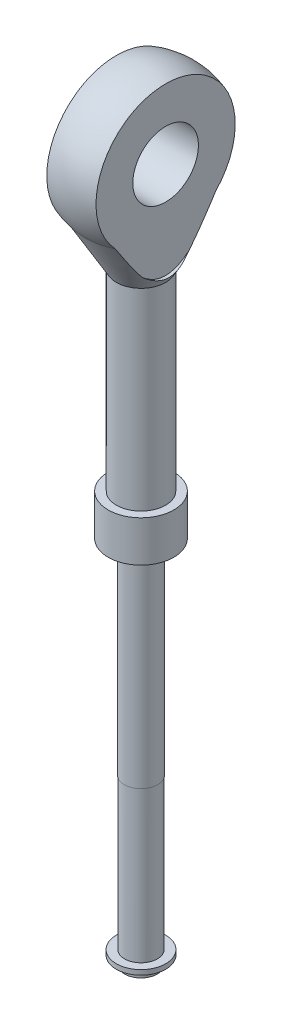
ISO-10303-21;
HEADER;
FILE_DESCRIPTION(('STEP AP214'),'2;1');
FILE_NAME('part.step','',(''),(''),'','','');
FILE_SCHEMA(('AUTOMOTIVE_DESIGN { 1 0 10303 214 1 1 1 1 }'));
ENDSEC;
DATA;
#1=APPLICATION_CONTEXT('core data for automotive mechanical design processes');
#2=APPLICATION_PROTOCOL_DEFINITION('international standard','automotive_design',2000,#1);
#3=PRODUCT_CONTEXT('',#1,'mechanical');
#4=PRODUCT('Part','Part','',(#3));
#5=PRODUCT_RELATED_PRODUCT_CATEGORY('part','',(#4));
#6=PRODUCT_DEFINITION_FORMATION('','',#4);
#7=PRODUCT_DEFINITION_CONTEXT('part definition',#1,'design');
#8=PRODUCT_DEFINITION('design','',#6,#7);
#9=PRODUCT_DEFINITION_SHAPE('','',#8);
#10=(LENGTH_UNIT() NAMED_UNIT(*) SI_UNIT(.MILLI.,.METRE.));
#11=(NAMED_UNIT(*) PLANE_ANGLE_UNIT() SI_UNIT($,.RADIAN.));
#12=(NAMED_UNIT(*) SI_UNIT($,.STERADIAN.) SOLID_ANGLE_UNIT());
#13=UNCERTAINTY_MEASURE_WITH_UNIT(LENGTH_MEASURE(1.E-05),#10,'distance_accuracy_value','');
#14=(GEOMETRIC_REPRESENTATION_CONTEXT(3) GLOBAL_UNCERTAINTY_ASSIGNED_CONTEXT((#13)) GLOBAL_UNIT_ASSIGNED_CONTEXT((#10,
#11,#12)) REPRESENTATION_CONTEXT('',''));
#15=CARTESIAN_POINT('',(0.,0.,0.));
#16=DIRECTION('',(0.,0.,1.));
#17=DIRECTION('',(1.,0.,0.));
#18=AXIS2_PLACEMENT_3D('',#15,#16,#17);
#19=CARTESIAN_POINT('',(0.,86.0040086442886,0.));
#20=DIRECTION('',(0.,1.,0.));
#21=DIRECTION('',(-1.,0.,0.));
#22=AXIS2_PLACEMENT_3D('',#19,#20,#21);
#23=SPHERICAL_SURFACE('',#22,9.);
#24=CARTESIAN_POINT('',(3.,86.0040086442886,0.));
#25=DIRECTION('',(-1.,0.,0.));
#26=DIRECTION('',(0.,0.,1.));
#27=AXIS2_PLACEMENT_3D('',#24,#25,#26);
#28=CIRCLE('',#27,8.48528137423857);
#29=CARTESIAN_POINT('',(3.,80.1211860557444,-6.11493241105035));
#30=VERTEX_POINT('',#29);
#31=CARTESIAN_POINT('',(3.,80.1211860557444,6.11493241105034));
#32=VERTEX_POINT('',#31);
#33=EDGE_CURVE('E84',#30,#32,#28,.F.);
#34=ORIENTED_EDGE('',*,*,#33,.F.);
#35=CARTESIAN_POINT('',(0.,80.1211860557444,0.));
#36=DIRECTION('',(0.,1.,0.));
#37=DIRECTION('',(-1.,0.,0.));
#38=AXIS2_PLACEMENT_3D('',#35,#36,#37);
#39=CIRCLE('',#38,6.81119654625485);
#40=CARTESIAN_POINT('',(-3.,80.1211860557444,-6.11493241105034));
#41=VERTEX_POINT('',#40);
#42=EDGE_CURVE('E188',#30,#41,#39,.T.);
#43=ORIENTED_EDGE('',*,*,#42,.T.);
#44=CARTESIAN_POINT('',(-3.,86.0040086442886,0.));
#45=DIRECTION('',(1.,0.,0.));
#46=DIRECTION('',(0.,0.,-1.));
#47=AXIS2_PLACEMENT_3D('',#44,#45,#46);
#48=CIRCLE('',#47,8.48528137423857);
#49=CARTESIAN_POINT('',(-3.,80.1211860557444,6.11493241105035));
#50=VERTEX_POINT('',#49);
#51=EDGE_CURVE('E229',#50,#41,#48,.F.);
#52=ORIENTED_EDGE('',*,*,#51,.F.);
#53=EDGE_CURVE('E104',#50,#32,#39,.T.);
#54=ORIENTED_EDGE('',*,*,#53,.T.);
#55=EDGE_LOOP('',(#34,#43,#52,#54));
#56=FACE_BOUND('',#55,.T.);
#57=ADVANCED_FACE('F40',(#56),#23,.T.);
#58=CARTESIAN_POINT('',(0.,80.1211860557444,0.));
#59=DIRECTION('',(0.,1.,0.));
#60=DIRECTION('',(-1.,0.,0.));
#61=AXIS2_PLACEMENT_3D('',#58,#59,#60);
#62=CONICAL_SURFACE('',#61,6.81119654625485,0.5235987755983);
#63=CARTESIAN_POINT('',(3.,90.0317216097129,12.168700218284));
#64=CARTESIAN_POINT('',(3.,89.4382406915781,11.8157499478809));
#65=CARTESIAN_POINT('',(3.,88.8451075580213,11.4622109965136));
#66=CARTESIAN_POINT('',(3.,87.659781910573,10.7533686630429));
#67=CARTESIAN_POINT('',(3.,87.067589543096,10.3980650361896));
#68=CARTESIAN_POINT('',(3.,85.8818106051358,9.68354997630611));
#69=CARTESIAN_POINT('',(3.,85.2882303494418,9.32432805553555));
#70=CARTESIAN_POINT('',(3.,84.1030618730578,8.60277571787523));
#71=CARTESIAN_POINT('',(3.,83.5114734077622,8.24044570362834));
#72=CARTESIAN_POINT('',(3.,82.6225023997788,7.69121429969309));
#73=CARTESIAN_POINT('',(3.,82.3240659074994,7.50601921420662));
#74=CARTESIAN_POINT('',(3.,81.7281047680208,7.13416838224338));
#75=CARTESIAN_POINT('',(3.,81.4305801180743,6.9475126401734));
#76=CARTESIAN_POINT('',(3.,80.8365627508458,6.57230122932124));
#77=CARTESIAN_POINT('',(3.,80.5400704961296,6.38374482741769));
#78=CARTESIAN_POINT('',(3.,79.9485858454352,6.00430627463545));
#79=CARTESIAN_POINT('',(3.,79.6535934141857,5.81342417881189));
#80=CARTESIAN_POINT('',(3.,79.066268517673,5.42906288453613));
#81=CARTESIAN_POINT('',(3.,78.7739314959773,5.23559066657474));
#82=CARTESIAN_POINT('',(3.,78.1919893856413,4.84459280960307));
#83=CARTESIAN_POINT('',(3.,77.9023842091294,4.64706730162282));
#84=CARTESIAN_POINT('',(3.,77.3272309546283,4.24652122906827));
#85=CARTESIAN_POINT('',(3.,77.0416804971072,4.0435041092877));
#86=CARTESIAN_POINT('',(3.,76.6178706443515,3.73286576399993));
#87=CARTESIAN_POINT('',(3.,76.4773653220144,3.62831020391789));
#88=CARTESIAN_POINT('',(3.,76.1982777100872,3.41666704144675));
#89=CARTESIAN_POINT('',(3.,76.0596953112071,3.30957958390188));
#90=CARTESIAN_POINT('',(3.,75.8747989309065,3.16327040881801));
#91=CARTESIAN_POINT('',(3.,75.8273818467308,3.1254403633148));
#92=CARTESIAN_POINT('',(3.,75.7328802284512,3.04936468537061));
#93=CARTESIAN_POINT('',(3.,75.6857957030233,3.01111904215307));
#94=CARTESIAN_POINT('',(3.,75.5450867923799,2.89570208608211));
#95=CARTESIAN_POINT('',(3.,75.4520135073028,2.81785582178286));
#96=CARTESIAN_POINT('',(3.,75.2673697404668,2.65974724133965));
#97=CARTESIAN_POINT('',(3.,75.1758056851449,2.57947739965793));
#98=CARTESIAN_POINT('',(3.,74.9950142544657,2.41635099384556));
#99=CARTESIAN_POINT('',(3.,74.9057867103646,2.33349461746816));
#100=CARTESIAN_POINT('',(3.,74.7253674914011,2.15984324306048));
#101=CARTESIAN_POINT('',(3.,74.6343515198,2.06886453738304));
#102=CARTESIAN_POINT('',(3.,74.4568090319896,1.88249940937497));
#103=CARTESIAN_POINT('',(3.,74.3702848488625,1.78711074414356));
#104=CARTESIAN_POINT('',(3.,74.203880753241,1.59128618412983));
#105=CARTESIAN_POINT('',(3.,74.1239762113704,1.49087145618605));
#106=CARTESIAN_POINT('',(3.,73.9732433626545,1.28351192700046));
#107=CARTESIAN_POINT('',(3.,73.9024029287037,1.17657613957347));
#108=CARTESIAN_POINT('',(3.,73.7805695996317,0.966451307545471));
#109=CARTESIAN_POINT('',(3.,73.7282789886254,0.864028431115715));
#110=CARTESIAN_POINT('',(3.,73.6386366009642,0.652732100806439));
#111=CARTESIAN_POINT('',(3.,73.6012619050635,0.543868840871251));
#112=CARTESIAN_POINT('',(3.,73.559781693372,0.37613413053505));
#113=CARTESIAN_POINT('',(3.,73.5483562281123,0.319041613266631));
#114=CARTESIAN_POINT('',(3.,73.5310608429829,0.204033323995488));
#115=CARTESIAN_POINT('',(3.,73.525187941715,0.146118010762109));
#116=CARTESIAN_POINT('',(3.,73.5192876580133,0.0299914911495062));
#117=CARTESIAN_POINT('',(3.,73.5192597381448,-0.0282196875332625));
#118=CARTESIAN_POINT('',(3.,73.525037139723,-0.14433696147935));
#119=CARTESIAN_POINT('',(3.,73.5308422992964,-0.202243065163956));
#120=CARTESIAN_POINT('',(3.,73.5542260815381,-0.358638552878588));
#121=CARTESIAN_POINT('',(3.,73.577271487356,-0.456338339746016));
#122=CARTESIAN_POINT('',(3.,73.6370722704449,-0.647301530251859));
#123=CARTESIAN_POINT('',(3.,73.6738331133625,-0.740563148537059));
#124=CARTESIAN_POINT('',(3.,73.755589077184,-0.917317207215517));
#125=CARTESIAN_POINT('',(3.,73.8000434455604,-1.00106543109804));
#126=CARTESIAN_POINT('',(3.,73.8960829635573,-1.16440859380673));
#127=CARTESIAN_POINT('',(3.,73.9476747246079,-1.24399958648436));
#128=CARTESIAN_POINT('',(3.,74.056463582699,-1.39978566722164));
#129=CARTESIAN_POINT('',(3.,74.1136866737394,-1.47596239525551));
#130=CARTESIAN_POINT('',(3.,74.2322051434531,-1.62499472393064));
#131=CARTESIAN_POINT('',(3.,74.2934986610117,-1.69785181705794));
#132=CARTESIAN_POINT('',(3.,74.416820749987,-1.83800833856632));
#133=CARTESIAN_POINT('',(3.,74.4787296507064,-1.90541373898406));
#134=CARTESIAN_POINT('',(3.,74.6048766456202,-2.03801479987947));
#135=CARTESIAN_POINT('',(3.,74.6691150517269,-2.10321016216323));
#136=CARTESIAN_POINT('',(3.,74.8646952607046,-2.29604275359632));
#137=CARTESIAN_POINT('',(3.,74.9988293778066,-2.42084603276168));
#138=CARTESIAN_POINT('',(3.,75.2723919204941,-2.66509747567585));
#139=CARTESIAN_POINT('',(3.,75.4118321346984,-2.78453225378144));
#140=CARTESIAN_POINT('',(3.,75.6943011652691,-3.01909976029167));
#141=CARTESIAN_POINT('',(3.,75.8373304351151,-3.13423194043869));
#142=CARTESIAN_POINT('',(3.,76.1272104428136,-3.36206864070766));
#143=CARTESIAN_POINT('',(3.,76.2740829689065,-3.47474530811504));
#144=CARTESIAN_POINT('',(3.,76.5698730828963,-3.69739679538881));
#145=CARTESIAN_POINT('',(3.,76.7187908198471,-3.80737141668492));
#146=CARTESIAN_POINT('',(3.,77.0179652511954,-4.02495482493047));
#147=CARTESIAN_POINT('',(3.,77.1682193274144,-4.13256721989711));
#148=CARTESIAN_POINT('',(3.,77.4699844271883,-4.34600183579561));
#149=CARTESIAN_POINT('',(3.,77.6214954123623,-4.4518241110927));
#150=CARTESIAN_POINT('',(3.,78.027757288913,-4.73265188833206));
#151=CARTESIAN_POINT('',(3.,78.2834245611178,-4.90633111554133));
#152=CARTESIAN_POINT('',(3.,78.7968345072581,-5.25059867156036));
#153=CARTESIAN_POINT('',(3.,79.0545772379262,-5.42118691546101));
#154=CARTESIAN_POINT('',(3.,79.5716523174998,-5.75998735813319));
#155=CARTESIAN_POINT('',(3.,79.8309848134444,-5.92819933221733));
#156=CARTESIAN_POINT('',(3.,80.3508668509719,-6.26273339980395));
#157=CARTESIAN_POINT('',(3.,80.6114164016771,-6.42905547910877));
#158=CARTESIAN_POINT('',(3.,81.3950642347187,-6.92612513901488));
#159=CARTESIAN_POINT('',(3.,81.9195976970134,-7.25460920510274));
#160=CARTESIAN_POINT('',(3.,82.9711419209881,-7.907509826911));
#161=CARTESIAN_POINT('',(3.,83.4981525461237,-8.23192660329294));
#162=CARTESIAN_POINT('',(3.,84.5246793943521,-8.85997517248131));
#163=CARTESIAN_POINT('',(3.,85.0241005947331,-9.16376240686782));
#164=CARTESIAN_POINT('',(3.,86.0241163223545,-9.76941744177886));
#165=CARTESIAN_POINT('',(3.,86.524710869848,-10.0712852088328));
#166=CARTESIAN_POINT('',(3.,87.5259893999254,-10.6730697781595));
#167=CARTESIAN_POINT('',(3.,88.0266719793256,-10.9729889166156));
#168=CARTESIAN_POINT('',(3.,89.028724270981,-11.5716505637281));
#169=CARTESIAN_POINT('',(3.,89.5300939668022,-11.8703930998859));
#170=CARTESIAN_POINT('',(3.,90.0317216097129,-12.168700218284));
#171=B_SPLINE_CURVE_WITH_KNOTS('',3,(#63,#64,#65,#66,#67,#68,#69,#70,#71,#72,#73,#74,#75,#76,
#77,#78,#79,#80,#81,#82,#83,#84,#85,#86,#87,#88,#89,#90,#91,#92,#93,#94,#95,#96,#97,#98,#99,
#100,#101,#102,#103,#104,#105,#106,#107,#108,#109,#110,#111,#112,#113,#114,#115,#116,#117,#118,
#119,#120,#121,#122,#123,#124,#125,#126,#127,#128,#129,#130,#131,#132,#133,#134,#135,#136,#137,
#138,#139,#140,#141,#142,#143,#144,#145,#146,#147,#148,#149,#150,#151,#152,#153,#154,#155,#156,
#157,#158,#159,#160,#161,#162,#163,#164,#165,#166,#167,#168,#169,#170),.UNSPECIFIED.,.F.,.F.,(4,
2,2,2,2,2,2,2,2,2,2,2,2,2,2,2,2,2,2,2,2,2,2,2,2,2,2,2,2,2,2,2,2,2,2,2,2,2,2,2,2,2,2,2,2,2,2,2,2,
2,2,2,2,4),(0.,2.07150978561819,4.14331538084254,6.22475142290114,8.30592177615951,
9.35960450625591,10.4132840586324,11.4673868982463,12.5214648328506,13.5731191803613,
14.6247395846088,15.6757149606122,16.2011115258233,16.7264781066445,16.9084526211625,
17.0904318656428,17.4544149359295,17.8196764181021,18.1849114477817,18.5708648295201,
18.9570167139165,19.3416604870031,19.7257841308158,20.0699752859951,20.4136355144541,
20.5880764974489,20.7624237626776,20.9367549970061,21.1110813936144,21.4108862712865,
21.7108107500127,21.9948126704668,22.2790794481779,22.56472612749,22.8502430884725,
23.1247405190978,23.3992748406117,23.9486681764211,24.4993629288371,25.0501276157957,
25.6054346266929,26.1607823251392,26.7152126471412,27.2696261009805,28.1968311261045,
29.1240615829944,30.0513791347962,30.9787036483837,32.8353711110087,34.6919374046442,
36.4456059209505,38.1993049333712,39.9502203360859,41.7010945677686),.UNSPECIFIED.);
#172=CARTESIAN_POINT('',(3.00000000000001,75.4236608623091,2.79312647703182));
#173=VERTEX_POINT('',#172);
#174=EDGE_CURVE('E80',#32,#173,#171,.T.);
#175=ORIENTED_EDGE('',*,*,#174,.F.);
#176=ORIENTED_EDGE('',*,*,#53,.F.);
#177=CARTESIAN_POINT('',(-3.,89.0244617467357,-11.5688580103673));
#178=CARTESIAN_POINT('',(-3.,88.4921295889113,-11.2513140874213));
#179=CARTESIAN_POINT('',(-3.,87.9601281346009,-10.9332123896199));
#180=CARTESIAN_POINT('',(-3.,86.8969693584094,-10.2953723277993));
#181=CARTESIAN_POINT('',(-3.,86.3658122172094,-9.97563366271791));
#182=CARTESIAN_POINT('',(-3.,85.3015811233849,-9.33221673054897));
#183=CARTESIAN_POINT('',(-3.,84.7685144918123,-9.00852634487636));
#184=CARTESIAN_POINT('',(-3.,83.7041821001664,-8.35840311324479));
#185=CARTESIAN_POINT('',(-3.,83.1729160389006,-8.03197076131658));
#186=CARTESIAN_POINT('',(-3.,82.3415839665515,-7.51688282348457));
#187=CARTESIAN_POINT('',(-3.,82.0406887849902,-7.32956588726583));
#188=CARTESIAN_POINT('',(-3.,81.4398971377041,-6.95333796050274));
#189=CARTESIAN_POINT('',(-3.,81.1400006684187,-6.76442697565008));
#190=CARTESIAN_POINT('',(-3.,80.5413061289178,-6.38448567772224));
#191=CARTESIAN_POINT('',(-3.,80.2425088025948,-6.19345419119735));
#192=CARTESIAN_POINT('',(-3.,79.6465929905049,-5.80880924172397));
#193=CARTESIAN_POINT('',(-3.,79.3494744429213,-5.61519587474048));
#194=CARTESIAN_POINT('',(-3.,78.7585049827187,-5.22521926498285));
#195=CARTESIAN_POINT('',(-3.,78.4646463599206,-5.02886772470208));
#196=CARTESIAN_POINT('',(-3.,77.8799953272648,-4.63152741527655));
#197=CARTESIAN_POINT('',(-3.,77.5892034024548,-4.43053792812963));
#198=CARTESIAN_POINT('',(-3.,77.1566252435166,-4.12424979070277));
#199=CARTESIAN_POINT('',(-3.,77.0131028491293,-4.02140411373894));
#200=CARTESIAN_POINT('',(-3.,76.7275060836031,-3.81372407979883));
#201=CARTESIAN_POINT('',(-3.,76.5854316756764,-3.70888977354067));
#202=CARTESIAN_POINT('',(-3.,76.3031504454941,-3.49681189166142));
#203=CARTESIAN_POINT('',(-3.,76.1629431189906,-3.38956898845638));
#204=CARTESIAN_POINT('',(-3.,75.884903950074,-3.17205375276586));
#205=CARTESIAN_POINT('',(-3.,75.7470719039783,-3.06178168215923));
#206=CARTESIAN_POINT('',(-3.,75.5461989275548,-2.89635709784405));
#207=CARTESIAN_POINT('',(-3.,75.4819265387069,-2.84269865255659));
#208=CARTESIAN_POINT('',(-3.,75.3542116715627,-2.73439486719465));
#209=CARTESIAN_POINT('',(-3.,75.2907692357431,-2.67974947694679));
#210=CARTESIAN_POINT('',(-3.,75.1648280320631,-2.56931903639512));
#211=CARTESIAN_POINT('',(-3.,75.1023297307238,-2.51353345278843));
#212=CARTESIAN_POINT('',(-3.,74.9784916386758,-2.40069350942453));
#213=CARTESIAN_POINT('',(-3.,74.9171518277429,-2.34363917185438));
#214=CARTESIAN_POINT('',(-3.,74.7361216226362,-2.17120048802878));
#215=CARTESIAN_POINT('',(-3.,74.618437133311,-2.05368877839343));
#216=CARTESIAN_POINT('',(-3.,74.3910097951584,-1.8112349691058));
#217=CARTESIAN_POINT('',(-3.,74.2812602427922,-1.68629930781483));
#218=CARTESIAN_POINT('',(-3.,74.135812889995,-1.50392647852383));
#219=CARTESIAN_POINT('',(-3.,74.0949476584839,-1.45061441757395));
#220=CARTESIAN_POINT('',(-3.,74.0156947442278,-1.34218343993368));
#221=CARTESIAN_POINT('',(-3.,73.9773069958032,-1.2870645712012));
#222=CARTESIAN_POINT('',(-3.,73.8665061594473,-1.11857807510415));
#223=CARTESIAN_POINT('',(-3.,73.7985466598955,-1.00219148050185));
#224=CARTESIAN_POINT('',(-3.,73.6794420522367,-0.758041198317624));
#225=CARTESIAN_POINT('',(-3.,73.6286181948079,-0.630111715681514));
#226=CARTESIAN_POINT('',(-3.,73.5725755103631,-0.4327387473672));
#227=CARTESIAN_POINT('',(-3.,73.5572680411791,-0.366138646046975));
#228=CARTESIAN_POINT('',(-3.,73.534180877927,-0.231632973810041));
#229=CARTESIAN_POINT('',(-3.,73.5263984679964,-0.163727882906772));
#230=CARTESIAN_POINT('',(-3.,73.5194249404224,-0.0374016592874153));
#231=CARTESIAN_POINT('',(-3.,73.519148309969,0.020961439206003));
#232=CARTESIAN_POINT('',(-3.,73.5244725210162,0.137437495824002));
#233=CARTESIAN_POINT('',(-3.,73.5300752994235,0.195550365178576));
#234=CARTESIAN_POINT('',(-3.,73.5468987432795,0.311025774104685));
#235=CARTESIAN_POINT('',(-3.,73.5581267157704,0.368387237903616));
#236=CARTESIAN_POINT('',(-3.,73.5857045521343,0.481882001013793));
#237=CARTESIAN_POINT('',(-3.,73.6020580503198,0.538014398532684));
#238=CARTESIAN_POINT('',(-3.,73.6685057115828,0.735706909897615));
#239=CARTESIAN_POINT('',(-3.,73.731275152493,0.873090585905248));
#240=CARTESIAN_POINT('',(-3.,73.8399787183451,1.07075374967075));
#241=CARTESIAN_POINT('',(-3.,73.8787236220289,1.13535139801526));
#242=CARTESIAN_POINT('',(-3.,73.9601467838349,1.26203631531047));
#243=CARTESIAN_POINT('',(-3.,74.0028242576449,1.32412408129389));
#244=CARTESIAN_POINT('',(-3.,74.1146798224324,1.4782041038997));
#245=CARTESIAN_POINT('',(-3.,74.1859471698282,1.56866673066896));
#246=CARTESIAN_POINT('',(-3.,74.3337736816723,1.74519275915911));
#247=CARTESIAN_POINT('',(-3.,74.4103359802488,1.83125350202931));
#248=CARTESIAN_POINT('',(-3.,74.5675216795534,1.99988677382243));
#249=CARTESIAN_POINT('',(-3.,74.6481530569388,2.08245181774962));
#250=CARTESIAN_POINT('',(-3.,74.8123970152884,2.24456606033062));
#251=CARTESIAN_POINT('',(-3.,74.8960099969697,2.32411485062387));
#252=CARTESIAN_POINT('',(-3.,75.0661030293614,2.48121981238464));
#253=CARTESIAN_POINT('',(-3.,75.1525983502752,2.55875938513696));
#254=CARTESIAN_POINT('',(-3.,75.3274439842175,2.71171904069293));
#255=CARTESIAN_POINT('',(-3.,75.4157943799672,2.78713902862838));
#256=CARTESIAN_POINT('',(-3.,75.59386128195,2.93608586725176));
#257=CARTESIAN_POINT('',(-3.,75.683575682059,3.00961524175049));
#258=CARTESIAN_POINT('',(-3.,75.8642222608192,3.15515193756142));
#259=CARTESIAN_POINT('',(-3.,75.9551543943272,3.22715931504282));
#260=CARTESIAN_POINT('',(-3.,76.2618461368404,3.46652422995947));
#261=CARTESIAN_POINT('',(-3.,76.4798911599765,3.63095419545278));
#262=CARTESIAN_POINT('',(-3.,76.9197403789327,3.95472030078216));
#263=CARTESIAN_POINT('',(-3.,77.1415450419487,4.11405580034195));
#264=CARTESIAN_POINT('',(-3.,77.5879162327383,4.42897773608877));
#265=CARTESIAN_POINT('',(-3.,77.8124837444079,4.58456277466135));
#266=CARTESIAN_POINT('',(-3.,78.2636076336265,4.89282399290127));
#267=CARTESIAN_POINT('',(-3.,78.490164053002,5.04550011117924));
#268=CARTESIAN_POINT('',(-3.,78.9451489045452,5.3488100943615));
#269=CARTESIAN_POINT('',(-3.,79.1735797081182,5.49944039657938));
#270=CARTESIAN_POINT('',(-3.,79.631637050792,5.79887457580867));
#271=CARTESIAN_POINT('',(-3.,79.861263602909,5.94767843287926));
#272=CARTESIAN_POINT('',(-3.,80.5514543256237,6.39181701266785));
#273=CARTESIAN_POINT('',(-3.,81.0134355200603,6.6849488569291));
#274=CARTESIAN_POINT('',(-3.,81.938228167338,7.26614146301739));
#275=CARTESIAN_POINT('',(-3.,82.4010305069388,7.55421677868495));
#276=CARTESIAN_POINT('',(-3.,83.3284365143108,8.12750777496666));
#277=CARTESIAN_POINT('',(-3.,83.7930402795362,8.41272329779089));
#278=CARTESIAN_POINT('',(-3.,84.7232454978762,8.98082980268928));
#279=CARTESIAN_POINT('',(-3.,85.1888460931005,9.26372219113208));
#280=CARTESIAN_POINT('',(-3.,86.1210354518243,9.82787426175203));
#281=CARTESIAN_POINT('',(-3.,86.5876242161852,10.1091339425049));
#282=CARTESIAN_POINT('',(-3.,87.2185343801636,10.4882698315908));
#283=CARTESIAN_POINT('',(-3.,87.3825191763526,10.5867067522454));
#284=CARTESIAN_POINT('',(-3.,87.7105895094916,10.7834423783616));
#285=CARTESIAN_POINT('',(-3.,87.8746750534496,10.8817410721395));
#286=CARTESIAN_POINT('',(-3.,88.2030076447442,11.0782522315111));
#287=CARTESIAN_POINT('',(-3.,88.3672547318212,11.1764646306968));
#288=CARTESIAN_POINT('',(-3.,88.6958103536837,11.3727565432624));
#289=CARTESIAN_POINT('',(-3.,88.8601188824584,11.470836066703));
#290=CARTESIAN_POINT('',(-3.,89.0244617467357,11.5688580103673));
#291=B_SPLINE_CURVE_WITH_KNOTS('',3,(#177,#178,#179,#180,#181,#182,#183,#184,#185,#186,#187,
#188,#189,#190,#191,#192,#193,#194,#195,#196,#197,#198,#199,#200,#201,#202,#203,#204,#205,#206,
#207,#208,#209,#210,#211,#212,#213,#214,#215,#216,#217,#218,#219,#220,#221,#222,#223,#224,#225,
#226,#227,#228,#229,#230,#231,#232,#233,#234,#235,#236,#237,#238,#239,#240,#241,#242,#243,#244,
#245,#246,#247,#248,#249,#250,#251,#252,#253,#254,#255,#256,#257,#258,#259,#260,#261,#262,#263,
#264,#265,#266,#267,#268,#269,#270,#271,#272,#273,#274,#275,#276,#277,#278,#279,#280,#281,#282,
#283,#284,#285,#286,#287,#288,#289,#290),.UNSPECIFIED.,.F.,.F.,(4,2,2,2,2,2,2,2,2,2,2,2,2,2,2,2,
2,2,2,2,2,2,2,2,2,2,2,2,2,2,2,2,2,2,2,2,2,2,2,2,2,2,2,2,2,2,2,2,2,2,2,2,2,2,2,2,4),(0.,
1.85954663345918,3.71944851825171,5.59038371775899,7.46098876085661,8.52429583523659,
9.58759911460017,10.6515234701854,11.715408390757,12.7756461226006,13.8360491062264,
14.3657372792316,14.8954119611507,15.4249405662478,15.9544235355014,16.2055958266256,
16.4567809227541,16.708086323515,16.9593873330773,17.4580903235018,17.9563669572525,
18.1578233890974,18.3592744780287,18.7626055000958,19.1731246676663,19.3777710647631,
19.5823435755109,19.7571431756228,19.9320003796273,20.1070853117173,20.2822946717081,
20.732461543658,20.9583848577246,21.184263210745,21.5294694371452,21.874881772468,
22.2209997285289,22.5671643782386,22.9156116989624,23.2640745907061,23.6120452310999,
23.9600030071575,24.7791633855382,25.5984263151211,26.417989966635,27.2375708949656,
28.0584320674992,28.8793021940994,30.5206613169523,32.1560576309606,33.79154368733,
35.4259533347038,37.0603644076027,37.6341479299448,38.2079773421529,38.7820896712543,
39.3561557847316),.UNSPECIFIED.);
#292=CARTESIAN_POINT('',(-3.,75.4236633253487,2.79312448322381));
#293=VERTEX_POINT('',#292);
#294=EDGE_CURVE('E192',#293,#50,#291,.T.);
#295=ORIENTED_EDGE('',*,*,#294,.F.);
#296=CARTESIAN_POINT('',(-3.,75.4232876539053,-2.79297030664514));
#297=CARTESIAN_POINT('',(-3.02439317343293,75.3521443282335,-2.70645602250348));
#298=CARTESIAN_POINT('',(-3.04837521829059,75.2826505739971,-2.61841294404533));
#299=CARTESIAN_POINT('',(-3.09540712839197,75.1472274300091,-2.4382784360176));
#300=CARTESIAN_POINT('',(-3.11844834877217,75.0813297670305,-2.34616096090762));
#301=CARTESIAN_POINT('',(-3.16316240566749,74.9543183287999,-2.15796244216656));
#302=CARTESIAN_POINT('',(-3.18483138568502,74.8932179294039,-2.06187138262452));
#303=CARTESIAN_POINT('',(-3.22669834518532,74.7760687070202,-1.86405577982547));
#304=CARTESIAN_POINT('',(-3.24686550944066,74.7201219520898,-1.76226372947855));
#305=CARTESIAN_POINT('',(-3.2848572802393,74.6159944780161,-1.55465386494298));
#306=CARTESIAN_POINT('',(-3.30268760809228,74.5677947236392,-1.44884673308011));
#307=CARTESIAN_POINT('',(-3.33534232282712,74.4803901388541,-1.23330545893428));
#308=CARTESIAN_POINT('',(-3.35017195009883,74.4411696111958,-1.12357856348331));
#309=CARTESIAN_POINT('',(-3.37319220171469,74.3805706736658,-0.925676968355511));
#310=CARTESIAN_POINT('',(-3.38212585052571,74.3571633193108,-0.838208994649943));
#311=CARTESIAN_POINT('',(-3.39750181093107,74.3170618470822,-0.661498803031819));
#312=CARTESIAN_POINT('',(-3.40394370325086,74.3003688589801,-0.572256289180739));
#313=CARTESIAN_POINT('',(-3.41404595353697,74.2742397880073,-0.393200045163183));
#314=CARTESIAN_POINT('',(-3.4177256654112,74.2647532059248,-0.303394821400617));
#315=CARTESIAN_POINT('',(-3.42222898278664,74.2531140793086,-0.123238371546315));
#316=CARTESIAN_POINT('',(-3.42305278418695,74.2509610317367,-0.0328871833305148));
#317=CARTESIAN_POINT('',(-3.42186345562618,74.2541513747348,0.147936669517103));
#318=CARTESIAN_POINT('',(-3.41984165463753,74.2595176778058,0.238408862537525));
#319=CARTESIAN_POINT('',(-3.41290436390222,74.2774138854433,0.418525411045759));
#320=CARTESIAN_POINT('',(-3.40798880007725,74.2899439733975,0.508169745281289));
#321=CARTESIAN_POINT('',(-3.3955450472824,74.322041857712,0.686266415702858));
#322=CARTESIAN_POINT('',(-3.38800930633637,74.341630003069,0.774714530116257));
#323=CARTESIAN_POINT('',(-3.37057228207257,74.3872868397698,0.949683163734498));
#324=CARTESIAN_POINT('',(-3.36067076290483,74.4133561772493,1.03620348981284));
#325=CARTESIAN_POINT('',(-3.34206289647834,74.4628161555517,1.1817230218025));
#326=CARTESIAN_POINT('',(-3.33386787770388,74.4847222471864,1.24130025609733));
#327=CARTESIAN_POINT('',(-3.31654127175512,74.5311898633868,1.35927436664196));
#328=CARTESIAN_POINT('',(-3.30740958979724,74.5557516567041,1.41767112271867));
#329=CARTESIAN_POINT('',(-3.27880442822637,74.6331663603971,1.59105323731095));
#330=CARTESIAN_POINT('',(-3.25812546574772,74.6897364107113,1.70419523583938));
#331=CARTESIAN_POINT('',(-3.21427394308575,74.8110802455301,1.92562891948412));
#332=CARTESIAN_POINT('',(-3.191097797445,74.8758658501789,2.03391330563359));
#333=CARTESIAN_POINT('',(-3.14283969185649,75.0120224305372,2.24574484538208));
#334=CARTESIAN_POINT('',(-3.11775830858518,75.0833914149833,2.3492934173323));
#335=CARTESIAN_POINT('',(-3.07704349660704,75.2002301609046,2.509261257828));
#336=CARTESIAN_POINT('',(-3.06189099722551,75.2439156977637,2.56712403112745));
#337=CARTESIAN_POINT('',(-3.03121995651082,75.3326962590517,2.68126366836316));
#338=CARTESIAN_POINT('',(-3.01570316709407,75.3777847830964,2.73754605375895));
#339=CARTESIAN_POINT('',(-3.,75.4235649674562,2.79320526875368));
#340=B_SPLINE_CURVE_WITH_KNOTS('',3,(#296,#297,#298,#299,#300,#301,#302,#303,#304,#305,#306,
#307,#308,#309,#310,#311,#312,#313,#314,#315,#316,#317,#318,#319,#320,#321,#322,#323,#324,#325,
#326,#327,#328,#329,#330,#331,#332,#333,#334,#335,#336,#337,#338,#339),.UNSPECIFIED.,.F.,.F.,(4,
2,2,2,2,2,2,2,2,2,2,2,2,2,2,2,2,2,2,2,2,4),(0.,0.343945524371265,0.690551362610133,
1.0380916180319,1.39146842644643,1.74396321779393,2.09583699971255,2.36852595572448,
2.64126077570995,2.91206630042778,3.18285324907188,3.45446711966491,3.72608794368719,
3.9984982238167,4.27093567250443,4.46287378464442,4.65483133874053,5.03885863538683,
5.42344485755969,5.80791513366485,6.03009392354628,6.25136339811525),.UNSPECIFIED.);
#341=CARTESIAN_POINT('',(-3.,75.4234069359673,-2.7928723675498));
#342=VERTEX_POINT('',#341);
#343=EDGE_CURVE('E102',#342,#293,#340,.T.);
#344=ORIENTED_EDGE('',*,*,#343,.F.);
#345=EDGE_CURVE('E238',#41,#342,#291,.T.);
#346=ORIENTED_EDGE('',*,*,#345,.F.);
#347=ORIENTED_EDGE('',*,*,#42,.F.);
#348=CARTESIAN_POINT('',(3.,75.4234088041381,-2.79287087160829));
#349=VERTEX_POINT('',#348);
#350=EDGE_CURVE('E101',#349,#30,#171,.T.);
#351=ORIENTED_EDGE('',*,*,#350,.F.);
#352=CARTESIAN_POINT('',(3.,75.4232876539053,-2.79297030664514));
#353=CARTESIAN_POINT('',(3.02439317343292,75.3521443282335,-2.70645602250349));
#354=CARTESIAN_POINT('',(3.04837521829058,75.2826505739971,-2.61841294404535));
#355=CARTESIAN_POINT('',(3.09540712839194,75.1472274300091,-2.43827843601764));
#356=CARTESIAN_POINT('',(3.11844834877214,75.0813297670305,-2.34616096090767));
#357=CARTESIAN_POINT('',(3.16316240566747,74.9543183287999,-2.15796244216662));
#358=CARTESIAN_POINT('',(3.18483138568501,74.893217929404,-2.0618713826246));
#359=CARTESIAN_POINT('',(3.22669834518531,74.7760687070203,-1.86405577982557));
#360=CARTESIAN_POINT('',(3.24686550944064,74.7201219520899,-1.76226372947867));
#361=CARTESIAN_POINT('',(3.28485728023927,74.6159944780162,-1.55465386494312));
#362=CARTESIAN_POINT('',(3.30268760809223,74.5677947236393,-1.44884673308027));
#363=CARTESIAN_POINT('',(3.33534232282709,74.4803901388541,-1.23330545893448));
#364=CARTESIAN_POINT('',(3.35017195009883,74.4411696111959,-1.12357856348353));
#365=CARTESIAN_POINT('',(3.37319220171468,74.3805706736658,-0.925676968355748));
#366=CARTESIAN_POINT('',(3.38212585052569,74.3571633193109,-0.838208994650175));
#367=CARTESIAN_POINT('',(3.39750181093104,74.3170618470822,-0.661498803032044));
#368=CARTESIAN_POINT('',(3.40394370325084,74.3003688589801,-0.572256289180961));
#369=CARTESIAN_POINT('',(3.41404595353696,74.2742397880073,-0.3932000451634));
#370=CARTESIAN_POINT('',(3.41772566541118,74.2647532059248,-0.303394821400831));
#371=CARTESIAN_POINT('',(3.42222898278664,74.2531140793086,-0.123238371546524));
#372=CARTESIAN_POINT('',(3.42305278418695,74.2509610317367,-0.0328871833307215));
#373=CARTESIAN_POINT('',(3.42186345562618,74.2541513747348,0.147936669516904));
#374=CARTESIAN_POINT('',(3.41984165463753,74.2595176778057,0.238408862537331));
#375=CARTESIAN_POINT('',(3.41290436390222,74.2774138854432,0.418525411045577));
#376=CARTESIAN_POINT('',(3.40798880007725,74.2899439733974,0.508169745281112));
#377=CARTESIAN_POINT('',(3.39554504728241,74.3220418577119,0.686266415702688));
#378=CARTESIAN_POINT('',(3.38800930633639,74.341630003069,0.774714530116088));
#379=CARTESIAN_POINT('',(3.37057228207259,74.3872868397698,0.949683163734339));
#380=CARTESIAN_POINT('',(3.36067076290485,74.4133561772492,1.03620348981269));
#381=CARTESIAN_POINT('',(3.34206289647837,74.4628161555516,1.18172302180232));
#382=CARTESIAN_POINT('',(3.33386787770392,74.4847222471864,1.24130025609712));
#383=CARTESIAN_POINT('',(3.31654127175517,74.5311898633867,1.3592743666417));
#384=CARTESIAN_POINT('',(3.30740958979728,74.5557516567039,1.41767112271839));
#385=CARTESIAN_POINT('',(3.27880442822641,74.6331663603969,1.59105323731061));
#386=CARTESIAN_POINT('',(3.25812546574779,74.6897364107111,1.70419523583898));
#387=CARTESIAN_POINT('',(3.21427394308586,74.8110802455299,1.92562891948364));
#388=CARTESIAN_POINT('',(3.1910977974451,74.8758658501785,2.03391330563308));
#389=CARTESIAN_POINT('',(3.14283969185661,75.0120224305368,2.2457448453815));
#390=CARTESIAN_POINT('',(3.11775830858532,75.0833914149828,2.34929341733166));
#391=CARTESIAN_POINT('',(3.07704349660718,75.2002301609042,2.50926125782744));
#392=CARTESIAN_POINT('',(3.06189099722562,75.2439156977634,2.56712403112701));
#393=CARTESIAN_POINT('',(3.03121995651089,75.3326962590516,2.68126366836295));
#394=CARTESIAN_POINT('',(3.01570316709412,75.3777847830963,2.73754605375886));
#395=CARTESIAN_POINT('',(3.00000000000001,75.4235649674562,2.79320526875369));
#396=B_SPLINE_CURVE_WITH_KNOTS('',3,(#352,#353,#354,#355,#356,#357,#358,#359,#360,#361,#362,
#363,#364,#365,#366,#367,#368,#369,#370,#371,#372,#373,#374,#375,#376,#377,#378,#379,#380,#381,
#382,#383,#384,#385,#386,#387,#388,#389,#390,#391,#392,#393,#394,#395),.UNSPECIFIED.,.F.,.F.,(4,
2,2,2,2,2,2,2,2,2,2,2,2,2,2,2,2,2,2,2,2,4),(0.,0.343945524371247,0.690551362610071,
1.03809161803181,1.3914684264463,1.74396321779376,2.09583699971232,2.36852595572426,
2.64126077570974,2.91206630042758,3.18285324907169,3.45446711966474,3.72608794368703,
3.99849822381655,4.2709356725043,4.46287378464419,4.6548313387402,5.03885863538634,
5.42344485755903,5.80791513366402,6.03009392354588,6.25136339811528),.UNSPECIFIED.);
#397=EDGE_CURVE('E47',#349,#173,#396,.T.);
#398=ORIENTED_EDGE('',*,*,#397,.T.);
#399=EDGE_LOOP('',(#175,#176,#295,#344,#346,#347,#351,#398));
#400=FACE_BOUND('',#399,.T.);
#401=CARTESIAN_POINT('',(0.,73.52,0.));
#402=DIRECTION('',(0.,1.,0.));
#403=DIRECTION('',(-1.,0.,0.));
#404=AXIS2_PLACEMENT_3D('',#401,#402,#403);
#405=CIRCLE('',#404,3.);
#406=CARTESIAN_POINT('',(-3.,73.52,0.));
#407=VERTEX_POINT('',#406);
#408=EDGE_CURVE('E185',#407,#407,#405,.T.);
#409=ORIENTED_EDGE('',*,*,#408,.T.);
#410=EDGE_LOOP('',(#409));
#411=FACE_BOUND('',#410,.T.);
#412=ADVANCED_FACE('F98',(#400,#411),#62,.T.);
#413=CARTESIAN_POINT('',(0.,83.5040086442886,0.));
#414=DIRECTION('',(0.,1.,0.));
#415=DIRECTION('',(-1.,0.,0.));
#416=AXIS2_PLACEMENT_3D('',#413,#414,#415);
#417=CYLINDRICAL_SURFACE('',#416,3.);
#418=CARTESIAN_POINT('',(0.,50.,0.));
#419=DIRECTION('',(0.,1.,0.));
#420=DIRECTION('',(-1.,0.,0.));
#421=AXIS2_PLACEMENT_3D('',#418,#419,#420);
#422=CIRCLE('',#421,3.);
#423=CARTESIAN_POINT('',(-3.,50.,0.));
#424=VERTEX_POINT('',#423);
#425=EDGE_CURVE('E176',#424,#424,#422,.T.);
#426=ORIENTED_EDGE('',*,*,#425,.T.);
#427=EDGE_LOOP('',(#426));
#428=FACE_BOUND('',#427,.T.);
#429=ORIENTED_EDGE('',*,*,#408,.F.);
#430=EDGE_LOOP('',(#429));
#431=FACE_BOUND('',#430,.T.);
#432=ADVANCED_FACE('F273',(#428,#431),#417,.T.);
#433=CARTESIAN_POINT('',(-4.,50.,0.));
#434=DIRECTION('',(0.,1.,0.));
#435=DIRECTION('',(-1.,0.,0.));
#436=AXIS2_PLACEMENT_3D('',#433,#434,#435);
#437=PLANE('',#436);
#438=CARTESIAN_POINT('',(0.,50.,0.));
#439=DIRECTION('',(0.,1.,0.));
#440=DIRECTION('',(-1.,0.,0.));
#441=AXIS2_PLACEMENT_3D('',#438,#439,#440);
#442=CIRCLE('',#441,4.);
#443=CARTESIAN_POINT('',(-4.,50.,0.));
#444=VERTEX_POINT('',#443);
#445=EDGE_CURVE('E172',#444,#444,#442,.T.);
#446=ORIENTED_EDGE('',*,*,#445,.T.);
#447=EDGE_LOOP('',(#446));
#448=FACE_BOUND('',#447,.T.);
#449=ORIENTED_EDGE('',*,*,#425,.F.);
#450=EDGE_LOOP('',(#449));
#451=FACE_BOUND('',#450,.T.);
#452=ADVANCED_FACE('F398',(#448,#451),#437,.T.);
#453=CARTESIAN_POINT('',(0.,83.5040086442886,0.));
#454=DIRECTION('',(0.,1.,0.));
#455=DIRECTION('',(-1.,0.,0.));
#456=AXIS2_PLACEMENT_3D('',#453,#454,#455);
#457=CYLINDRICAL_SURFACE('',#456,4.);
#458=CARTESIAN_POINT('',(0.,45.,0.));
#459=DIRECTION('',(0.,1.,0.));
#460=DIRECTION('',(-1.,0.,0.));
#461=AXIS2_PLACEMENT_3D('',#458,#459,#460);
#462=CIRCLE('',#461,4.);
#463=CARTESIAN_POINT('',(-4.,45.,0.));
#464=VERTEX_POINT('',#463);
#465=EDGE_CURVE('E170',#464,#464,#462,.T.);
#466=ORIENTED_EDGE('',*,*,#465,.T.);
#467=EDGE_LOOP('',(#466));
#468=FACE_BOUND('',#467,.T.);
#469=ORIENTED_EDGE('',*,*,#445,.F.);
#470=EDGE_LOOP('',(#469));
#471=FACE_BOUND('',#470,.T.);
#472=ADVANCED_FACE('F166',(#468,#471),#457,.T.);
#473=CARTESIAN_POINT('',(-2.,45.,0.));
#474=DIRECTION('',(0.,-1.,0.));
#475=DIRECTION('',(1.,0.,0.));
#476=AXIS2_PLACEMENT_3D('',#473,#474,#475);
#477=PLANE('',#476);
#478=CARTESIAN_POINT('',(0.,45.,0.));
#479=DIRECTION('',(0.,-1.,0.));
#480=DIRECTION('',(1.,0.,0.));
#481=AXIS2_PLACEMENT_3D('',#478,#479,#480);
#482=CIRCLE('',#481,2.025);
#483=CARTESIAN_POINT('',(2.025,45.,0.));
#484=VERTEX_POINT('',#483);
#485=EDGE_CURVE('E133',#484,#484,#482,.T.);
#486=ORIENTED_EDGE('',*,*,#485,.F.);
#487=EDGE_LOOP('',(#486));
#488=FACE_BOUND('',#487,.T.);
#489=ORIENTED_EDGE('',*,*,#465,.F.);
#490=EDGE_LOOP('',(#489));
#491=FACE_BOUND('',#490,.T.);
#492=ADVANCED_FACE('F162',(#488,#491),#477,.T.);
#493=CARTESIAN_POINT('',(4.,86.0040086442886,0.));
#494=DIRECTION('',(-1.,0.,0.));
#495=DIRECTION('',(0.,0.,1.));
#496=AXIS2_PLACEMENT_3D('',#493,#494,#495);
#497=CYLINDRICAL_SURFACE('',#496,4.00000000000001);
#498=CARTESIAN_POINT('',(3.,86.0040086442886,0.));
#499=DIRECTION('',(-1.,0.,0.));
#500=DIRECTION('',(0.,0.,1.));
#501=AXIS2_PLACEMENT_3D('',#498,#499,#500);
#502=CIRCLE('',#501,4.00000000000001);
#503=CARTESIAN_POINT('',(3.,86.0040086442886,4.00000000000001));
#504=VERTEX_POINT('',#503);
#505=EDGE_CURVE('E94',#504,#504,#502,.F.);
#506=ORIENTED_EDGE('',*,*,#505,.T.);
#507=EDGE_LOOP('',(#506));
#508=FACE_BOUND('',#507,.T.);
#509=CARTESIAN_POINT('',(-3.,86.0040086442886,0.));
#510=DIRECTION('',(1.,0.,0.));
#511=DIRECTION('',(0.,0.,-1.));
#512=AXIS2_PLACEMENT_3D('',#509,#510,#511);
#513=CIRCLE('',#512,4.00000000000001);
#514=CARTESIAN_POINT('',(-3.,86.0040086442886,-4.00000000000001));
#515=VERTEX_POINT('',#514);
#516=EDGE_CURVE('E190',#515,#515,#513,.F.);
#517=ORIENTED_EDGE('',*,*,#516,.T.);
#518=EDGE_LOOP('',(#517));
#519=FACE_BOUND('',#518,.T.);
#520=ADVANCED_FACE('F165',(#508,#519),#497,.F.);
#521=CARTESIAN_POINT('',(-3.,74.252150639025,0.0256787408373612));
#522=DIRECTION('',(1.,0.,0.));
#523=DIRECTION('',(0.,0.,-1.));
#524=AXIS2_PLACEMENT_3D('',#521,#522,#523);
#525=PLANE('',#524);
#526=ORIENTED_EDGE('',*,*,#345,.T.);
#527=CARTESIAN_POINT('',(-3.,75.4235650496241,2.79320536864611));
#528=CARTESIAN_POINT('',(-3.,75.2224222089854,2.54867393589921));
#529=CARTESIAN_POINT('',(-3.,75.034701690075,2.29206016907734));
#530=CARTESIAN_POINT('',(-3.,74.7796723612038,1.8733588535988));
#531=CARTESIAN_POINT('',(-3.,74.6956000192459,1.71933135514937));
#532=CARTESIAN_POINT('',(-3.,74.5451805608345,1.40071599591124));
#533=CARTESIAN_POINT('',(-3.,74.4785058762138,1.23486095842605));
#534=CARTESIAN_POINT('',(-3.,74.3698641633838,0.898553898193731));
#535=CARTESIAN_POINT('',(-3.,74.3275442298161,0.727839454223414));
#536=CARTESIAN_POINT('',(-3.,74.2695270175792,0.380729476034696));
#537=CARTESIAN_POINT('',(-3.,74.2535354881238,0.202925795791827));
#538=CARTESIAN_POINT('',(-3.,74.2493809408276,-0.328815369071571));
#539=CARTESIAN_POINT('',(-3.,74.3037935253229,-0.676664628053384));
#540=CARTESIAN_POINT('',(-3.,74.5130416331235,-1.35654602222918));
#541=CARTESIAN_POINT('',(-3.,74.6624733642256,-1.67407631202433));
#542=CARTESIAN_POINT('',(-3.,75.0130651148357,-2.26242875240344));
#543=CARTESIAN_POINT('',(-3.,75.211173039883,-2.53510121184444));
#544=CARTESIAN_POINT('',(-3.,75.4232877743669,-2.79297045309106));
#545=B_SPLINE_CURVE_WITH_KNOTS('',3,(#527,#528,#529,#530,#531,#532,#533,#534,#535,#536,#537,
#538,#539,#540,#541,#542,#543,#544),.UNSPECIFIED.,.F.,.F.,(4,2,2,2,2,2,2,2,4),
(0.315819861755369,0.371934765350529,0.403184765350529,0.434434765350529,0.465684765350529,
0.496934765350529,0.559434765350529,0.621934765350529,0.68111490359516),.UNSPECIFIED.);
#546=EDGE_CURVE('E63',#342,#293,#545,.F.);
#547=ORIENTED_EDGE('',*,*,#546,.T.);
#548=ORIENTED_EDGE('',*,*,#294,.T.);
#549=ORIENTED_EDGE('',*,*,#51,.T.);
#550=EDGE_LOOP('',(#526,#547,#548,#549));
#551=FACE_BOUND('',#550,.T.);
#552=ORIENTED_EDGE('',*,*,#516,.F.);
#553=EDGE_LOOP('',(#552));
#554=FACE_BOUND('',#553,.T.);
#555=ADVANCED_FACE('F124',(#551,#554),#525,.F.);
#556=CARTESIAN_POINT('',(-3.,79.4616147047422,-6.27069350521821));
#557=CARTESIAN_POINT('',(-3.,78.8880136752076,-5.86015523813952));
#558=CARTESIAN_POINT('',(-3.,78.3222821953276,-5.43982290142353));
#559=CARTESIAN_POINT('',(-3.,77.2195966403971,-4.5633432297707));
#560=CARTESIAN_POINT('',(-3.,76.6815578740365,-4.1063819536044));
#561=CARTESIAN_POINT('',(-3.,75.9263382161371,-3.36337402136028));
#562=CARTESIAN_POINT('',(-3.,75.6847433214876,-3.10680462953897));
#563=CARTESIAN_POINT('',(-3.,75.23348662388,-2.56565132167524));
#564=CARTESIAN_POINT('',(-3.,75.0226304897719,-2.2784810744477));
#565=CARTESIAN_POINT('',(-3.,74.6624733642256,-1.67407631202433));
#566=CARTESIAN_POINT('',(-3.,74.5130416331235,-1.35654602222918));
#567=CARTESIAN_POINT('',(-3.,74.3037935253229,-0.676664628053384));
#568=CARTESIAN_POINT('',(-3.,74.2493809408276,-0.328815369071571));
#569=CARTESIAN_POINT('',(-3.,74.2535354881238,0.202925795791827));
#570=CARTESIAN_POINT('',(-3.,74.2695270175792,0.380729476034696));
#571=CARTESIAN_POINT('',(-3.,74.3275442298161,0.727839454223414));
#572=CARTESIAN_POINT('',(-3.,74.3698641633838,0.898553898193731));
#573=CARTESIAN_POINT('',(-3.,74.4785058762138,1.23486095842605));
#574=CARTESIAN_POINT('',(-3.,74.5451805608345,1.40071599591124));
#575=CARTESIAN_POINT('',(-3.,74.6956000192459,1.71933135514937));
#576=CARTESIAN_POINT('',(-3.,74.7796723612038,1.8733588535988));
#577=CARTESIAN_POINT('',(-3.,75.05334060323,2.32266111012058));
#578=CARTESIAN_POINT('',(-3.,75.2654518033506,2.60691258662889));
#579=CARTESIAN_POINT('',(-3.,75.7200136424586,3.14550592938792));
#580=CARTESIAN_POINT('',(-3.,75.9609941511695,3.39901510275922));
#581=CARTESIAN_POINT('',(-3.,76.7092930242996,4.13032064689779));
#582=CARTESIAN_POINT('',(-3.,77.2405345680259,4.58054778611102));
#583=CARTESIAN_POINT('',(-3.,78.3323192579722,5.44723470219473));
#584=CARTESIAN_POINT('',(-3.,78.8928987406722,5.86365260466309));
#585=CARTESIAN_POINT('',(-3.,79.4616149171814,6.27069372686199));
#586=B_SPLINE_CURVE_WITH_KNOTS('',3,(#556,#557,#558,#559,#560,#561,#562,#563,#564,#565,#566,
#567,#568,#569,#570,#571,#572,#573,#574,#575,#576,#577,#578,#579,#580,#581,#582,#583,#584,#585),
.UNSPECIFIED.,.F.,.F.,(4,2,2,2,2,2,2,2,2,2,2,2,2,2,4),(0.,0.125,0.25,0.3125,0.375,0.4375,0.5,
0.53125,0.5625,0.59375,0.625,0.6875,0.75,0.875,1.),.UNSPECIFIED.);
#587=DIRECTION('',(-1.,0.,0.));
#588=VECTOR('',#587,1.);
#589=SURFACE_OF_LINEAR_EXTRUSION('',#586,#588);
#590=ORIENTED_EDGE('',*,*,#343,.T.);
#591=ORIENTED_EDGE('',*,*,#546,.F.);
#592=EDGE_LOOP('',(#590,#591));
#593=FACE_BOUND('',#592,.T.);
#594=ADVANCED_FACE('F198',(#593),#589,.F.);
#595=CARTESIAN_POINT('',(3.,74.252150639025,0.0256787408373612));
#596=DIRECTION('',(-1.,0.,0.));
#597=DIRECTION('',(0.,0.,-1.));
#598=AXIS2_PLACEMENT_3D('',#595,#596,#597);
#599=PLANE('',#598);
#600=ORIENTED_EDGE('',*,*,#174,.T.);
#601=CARTESIAN_POINT('',(3.,75.4232878689436,-2.79297056806849));
#602=CARTESIAN_POINT('',(3.,75.2111730987706,-2.53510129289631));
#603=CARTESIAN_POINT('',(3.,75.0130651401782,-2.26242879493249));
#604=CARTESIAN_POINT('',(3.,74.6624733642256,-1.67407631202433));
#605=CARTESIAN_POINT('',(3.,74.5130416331235,-1.35654602222918));
#606=CARTESIAN_POINT('',(3.,74.3037935253229,-0.676664628053384));
#607=CARTESIAN_POINT('',(3.,74.2493809408276,-0.328815369071571));
#608=CARTESIAN_POINT('',(3.,74.2535354881238,0.202925795791827));
#609=CARTESIAN_POINT('',(3.,74.2695270175792,0.380729476034696));
#610=CARTESIAN_POINT('',(3.,74.3275442298161,0.727839454223414));
#611=CARTESIAN_POINT('',(3.,74.3698641633838,0.898553898193731));
#612=CARTESIAN_POINT('',(3.,74.4785058762138,1.23486095842605));
#613=CARTESIAN_POINT('',(3.,74.5451805608345,1.40071599591124));
#614=CARTESIAN_POINT('',(3.,74.6956000192459,1.71933135514937));
#615=CARTESIAN_POINT('',(3.,74.7796723612038,1.8733588535988));
#616=CARTESIAN_POINT('',(3.,75.0347016912006,2.29206017092535));
#617=CARTESIAN_POINT('',(3.,75.2224222115653,2.5486739394259));
#618=CARTESIAN_POINT('',(3.,75.4235650537706,2.79320537368707));
#619=B_SPLINE_CURVE_WITH_KNOTS('',3,(#601,#602,#603,#604,#605,#606,#607,#608,#609,#610,#611,
#612,#613,#614,#615,#616,#617,#618),.UNSPECIFIED.,.F.,.F.,(4,2,2,2,2,2,2,2,4),
(0.315819852959723,0.375,0.4375,0.5,0.53125,0.5625,0.59375,0.625,0.681114903980759),.UNSPECIFIED.);
#620=EDGE_CURVE('E54',#349,#173,#619,.T.);
#621=ORIENTED_EDGE('',*,*,#620,.F.);
#622=ORIENTED_EDGE('',*,*,#350,.T.);
#623=ORIENTED_EDGE('',*,*,#33,.T.);
#624=EDGE_LOOP('',(#600,#621,#622,#623));
#625=FACE_BOUND('',#624,.T.);
#626=ORIENTED_EDGE('',*,*,#505,.F.);
#627=EDGE_LOOP('',(#626));
#628=FACE_BOUND('',#627,.T.);
#629=ADVANCED_FACE('F81',(#625,#628),#599,.F.);
#630=CARTESIAN_POINT('',(3.,79.4616147047422,-6.27069350521821));
#631=CARTESIAN_POINT('',(3.,78.8880136752076,-5.86015523813952));
#632=CARTESIAN_POINT('',(3.,78.3222821953276,-5.43982290142353));
#633=CARTESIAN_POINT('',(3.,77.2195966403971,-4.5633432297707));
#634=CARTESIAN_POINT('',(3.,76.6815578740365,-4.1063819536044));
#635=CARTESIAN_POINT('',(3.,75.9263382161371,-3.36337402136028));
#636=CARTESIAN_POINT('',(3.,75.6847433214876,-3.10680462953897));
#637=CARTESIAN_POINT('',(3.,75.23348662388,-2.56565132167524));
#638=CARTESIAN_POINT('',(3.,75.0226304897719,-2.2784810744477));
#639=CARTESIAN_POINT('',(3.,74.6624733642256,-1.67407631202433));
#640=CARTESIAN_POINT('',(3.,74.5130416331235,-1.35654602222918));
#641=CARTESIAN_POINT('',(3.,74.3037935253229,-0.676664628053384));
#642=CARTESIAN_POINT('',(3.,74.2493809408276,-0.328815369071571));
#643=CARTESIAN_POINT('',(3.,74.2535354881238,0.202925795791827));
#644=CARTESIAN_POINT('',(3.,74.2695270175792,0.380729476034696));
#645=CARTESIAN_POINT('',(3.,74.3275442298161,0.727839454223414));
#646=CARTESIAN_POINT('',(3.,74.3698641633838,0.898553898193731));
#647=CARTESIAN_POINT('',(3.,74.4785058762138,1.23486095842605));
#648=CARTESIAN_POINT('',(3.,74.5451805608345,1.40071599591124));
#649=CARTESIAN_POINT('',(3.,74.6956000192459,1.71933135514937));
#650=CARTESIAN_POINT('',(3.,74.7796723612038,1.8733588535988));
#651=CARTESIAN_POINT('',(3.,75.05334060323,2.32266111012058));
#652=CARTESIAN_POINT('',(3.,75.2654518033506,2.60691258662889));
#653=CARTESIAN_POINT('',(3.,75.7200136424586,3.14550592938792));
#654=CARTESIAN_POINT('',(3.,75.9609941511695,3.39901510275922));
#655=CARTESIAN_POINT('',(3.,76.7092930242996,4.13032064689779));
#656=CARTESIAN_POINT('',(3.,77.2405345680259,4.58054778611102));
#657=CARTESIAN_POINT('',(3.,78.3323192579722,5.44723470219473));
#658=CARTESIAN_POINT('',(3.,78.8928987406722,5.86365260466309));
#659=CARTESIAN_POINT('',(3.,79.4616149171814,6.27069372686199));
#660=B_SPLINE_CURVE_WITH_KNOTS('',3,(#630,#631,#632,#633,#634,#635,#636,#637,#638,#639,#640,
#641,#642,#643,#644,#645,#646,#647,#648,#649,#650,#651,#652,#653,#654,#655,#656,#657,#658,#659),
.UNSPECIFIED.,.F.,.F.,(4,2,2,2,2,2,2,2,2,2,2,2,2,2,4),(0.,0.125,0.25,0.3125,0.375,0.4375,0.5,
0.53125,0.5625,0.59375,0.625,0.6875,0.75,0.875,1.),.UNSPECIFIED.);
#661=DIRECTION('',(1.,0.,0.));
#662=VECTOR('',#661,1.);
#663=SURFACE_OF_LINEAR_EXTRUSION('',#660,#662);
#664=ORIENTED_EDGE('',*,*,#620,.T.);
#665=ORIENTED_EDGE('',*,*,#397,.F.);
#666=EDGE_LOOP('',(#664,#665));
#667=FACE_BOUND('',#666,.T.);
#668=ADVANCED_FACE('F92',(#667),#663,.T.);
#669=CARTESIAN_POINT('',(0.,20.,0.));
#670=DIRECTION('',(0.,1.,0.));
#671=DIRECTION('',(-1.,0.,0.));
#672=AXIS2_PLACEMENT_3D('',#669,#670,#671);
#673=CYLINDRICAL_SURFACE('',#672,2.025);
#674=CARTESIAN_POINT('',(0.,20.,0.));
#675=DIRECTION('',(0.,-1.,0.));
#676=DIRECTION('',(1.,0.,0.));
#677=AXIS2_PLACEMENT_3D('',#674,#675,#676);
#678=CIRCLE('',#677,2.025);
#679=CARTESIAN_POINT('',(2.025,20.,0.));
#680=VERTEX_POINT('',#679);
#681=EDGE_CURVE('E95',#680,#680,#678,.T.);
#682=ORIENTED_EDGE('',*,*,#681,.F.);
#683=EDGE_LOOP('',(#682));
#684=FACE_BOUND('',#683,.T.);
#685=ORIENTED_EDGE('',*,*,#485,.T.);
#686=EDGE_LOOP('',(#685));
#687=FACE_BOUND('',#686,.T.);
#688=ADVANCED_FACE('F121',(#684,#687),#673,.T.);
#689=CARTESIAN_POINT('',(0.,20.,0.));
#690=DIRECTION('',(0.,-1.,0.));
#691=DIRECTION('',(1.,0.,0.));
#692=AXIS2_PLACEMENT_3D('',#689,#690,#691);
#693=PLANE('',#692);
#694=CARTESIAN_POINT('',(0.,20.,0.));
#695=DIRECTION('',(0.,-1.,0.));
#696=DIRECTION('',(1.,0.,0.));
#697=AXIS2_PLACEMENT_3D('',#694,#695,#696);
#698=CIRCLE('',#697,2.);
#699=CARTESIAN_POINT('',(2.,20.,0.));
#700=VERTEX_POINT('',#699);
#701=EDGE_CURVE('E11',#700,#700,#698,.F.);
#702=ORIENTED_EDGE('',*,*,#701,.T.);
#703=EDGE_LOOP('',(#702));
#704=FACE_BOUND('',#703,.T.);
#705=ORIENTED_EDGE('',*,*,#681,.T.);
#706=EDGE_LOOP('',(#705));
#707=FACE_BOUND('',#706,.T.);
#708=ADVANCED_FACE('F156',(#704,#707),#693,.T.);
#709=CARTESIAN_POINT('',(0.,0.,0.));
#710=DIRECTION('',(0.,-1.,0.));
#711=DIRECTION('',(1.,0.,0.));
#712=AXIS2_PLACEMENT_3D('',#709,#710,#711);
#713=PLANE('',#712);
#714=CARTESIAN_POINT('',(0.,0.,0.));
#715=DIRECTION('',(0.,1.,0.));
#716=DIRECTION('',(-1.,0.,0.));
#717=AXIS2_PLACEMENT_3D('',#714,#715,#716);
#718=CIRCLE('',#717,2.);
#719=CARTESIAN_POINT('',(-2.,0.,0.));
#720=VERTEX_POINT('',#719);
#721=EDGE_CURVE('E240',#720,#720,#718,.T.);
#722=ORIENTED_EDGE('',*,*,#721,.F.);
#723=EDGE_LOOP('',(#722));
#724=FACE_BOUND('',#723,.T.);
#725=ADVANCED_FACE('F314',(#724),#713,.T.);
#726=CARTESIAN_POINT('',(0.,83.5040086442886,0.));
#727=DIRECTION('',(0.,1.,0.));
#728=DIRECTION('',(-1.,0.,0.));
#729=AXIS2_PLACEMENT_3D('',#726,#727,#728);
#730=CYLINDRICAL_SURFACE('',#729,2.);
#731=ORIENTED_EDGE('',*,*,#721,.T.);
#732=EDGE_LOOP('',(#731));
#733=FACE_BOUND('',#732,.T.);
#734=CARTESIAN_POINT('',(0.,1.00924294583216,0.));
#735=DIRECTION('',(0.,1.,0.));
#736=DIRECTION('',(-1.,0.,0.));
#737=AXIS2_PLACEMENT_3D('',#734,#735,#736);
#738=CIRCLE('',#737,2.);
#739=CARTESIAN_POINT('',(-2.,1.00924294583216,0.));
#740=VERTEX_POINT('',#739);
#741=EDGE_CURVE('E243',#740,#740,#738,.T.);
#742=ORIENTED_EDGE('',*,*,#741,.F.);
#743=EDGE_LOOP('',(#742));
#744=FACE_BOUND('',#743,.T.);
#745=ADVANCED_FACE('F265',(#733,#744),#730,.T.);
#746=CARTESIAN_POINT('',(-2.,1.00924294583216,0.));
#747=DIRECTION('',(0.,-1.,0.));
#748=DIRECTION('',(1.,0.,0.));
#749=AXIS2_PLACEMENT_3D('',#746,#747,#748);
#750=PLANE('',#749);
#751=ORIENTED_EDGE('',*,*,#741,.T.);
#752=EDGE_LOOP('',(#751));
#753=FACE_BOUND('',#752,.T.);
#754=CARTESIAN_POINT('',(0.,1.00924294583216,0.));
#755=DIRECTION('',(0.,1.,0.));
#756=DIRECTION('',(-1.,0.,0.));
#757=AXIS2_PLACEMENT_3D('',#754,#755,#756);
#758=CIRCLE('',#757,3.0148350251693);
#759=CARTESIAN_POINT('',(-3.0148350251693,1.00924294583216,0.));
#760=VERTEX_POINT('',#759);
#761=EDGE_CURVE('E246',#760,#760,#758,.T.);
#762=ORIENTED_EDGE('',*,*,#761,.F.);
#763=EDGE_LOOP('',(#762));
#764=FACE_BOUND('',#763,.T.);
#765=ADVANCED_FACE('F256',(#753,#764),#750,.T.);
#766=CARTESIAN_POINT('',(0.,83.5040086442886,0.));
#767=DIRECTION('',(0.,1.,0.));
#768=DIRECTION('',(-1.,0.,0.));
#769=AXIS2_PLACEMENT_3D('',#766,#767,#768);
#770=CYLINDRICAL_SURFACE('',#769,3.0148350251693);
#771=ORIENTED_EDGE('',*,*,#761,.T.);
#772=EDGE_LOOP('',(#771));
#773=FACE_BOUND('',#772,.T.);
#774=CARTESIAN_POINT('',(0.,1.60052421760715,0.));
#775=DIRECTION('',(0.,1.,0.));
#776=DIRECTION('',(-1.,0.,0.));
#777=AXIS2_PLACEMENT_3D('',#774,#775,#776);
#778=CIRCLE('',#777,3.0148350251693);
#779=CARTESIAN_POINT('',(-3.0148350251693,1.60052421760715,0.));
#780=VERTEX_POINT('',#779);
#781=EDGE_CURVE('E179',#780,#780,#778,.T.);
#782=ORIENTED_EDGE('',*,*,#781,.F.);
#783=EDGE_LOOP('',(#782));
#784=FACE_BOUND('',#783,.T.);
#785=ADVANCED_FACE('F254',(#773,#784),#770,.T.);
#786=CARTESIAN_POINT('',(-3.0148350251693,1.60052421760715,0.));
#787=DIRECTION('',(0.,1.,0.));
#788=DIRECTION('',(-1.,0.,0.));
#789=AXIS2_PLACEMENT_3D('',#786,#787,#788);
#790=PLANE('',#789);
#791=ORIENTED_EDGE('',*,*,#781,.T.);
#792=EDGE_LOOP('',(#791));
#793=FACE_BOUND('',#792,.T.);
#794=CARTESIAN_POINT('',(0.,1.60052421760715,0.));
#795=DIRECTION('',(0.,1.,0.));
#796=DIRECTION('',(-1.,0.,0.));
#797=AXIS2_PLACEMENT_3D('',#794,#795,#796);
#798=CIRCLE('',#797,2.);
#799=CARTESIAN_POINT('',(-2.,1.60052421760715,0.));
#800=VERTEX_POINT('',#799);
#801=EDGE_CURVE('E173',#800,#800,#798,.T.);
#802=ORIENTED_EDGE('',*,*,#801,.F.);
#803=EDGE_LOOP('',(#802));
#804=FACE_BOUND('',#803,.T.);
#805=ADVANCED_FACE('F251',(#793,#804),#790,.T.);
#806=CARTESIAN_POINT('',(0.,83.5040086442886,0.));
#807=DIRECTION('',(0.,1.,0.));
#808=DIRECTION('',(-1.,0.,0.));
#809=AXIS2_PLACEMENT_3D('',#806,#807,#808);
#810=CYLINDRICAL_SURFACE('',#809,2.);
#811=ORIENTED_EDGE('',*,*,#701,.F.);
#812=EDGE_LOOP('',(#811));
#813=FACE_BOUND('',#812,.T.);
#814=ORIENTED_EDGE('',*,*,#801,.T.);
#815=EDGE_LOOP('',(#814));
#816=FACE_BOUND('',#815,.T.);
#817=ADVANCED_FACE('F263',(#813,#816),#810,.T.);
#818=CLOSED_SHELL('',(#57,#412,#432,#452,#472,#492,#520,#555,#594,#629,#668,#688,#708,#725,#745,
#765,#785,#805,#817));
#819=MANIFOLD_SOLID_BREP('B2',#818);
#820=ADVANCED_BREP_SHAPE_REPRESENTATION('',(#18,#819),#14);
#821=SHAPE_DEFINITION_REPRESENTATION(#9,#820);
ENDSEC;
END-ISO-10303-21;
